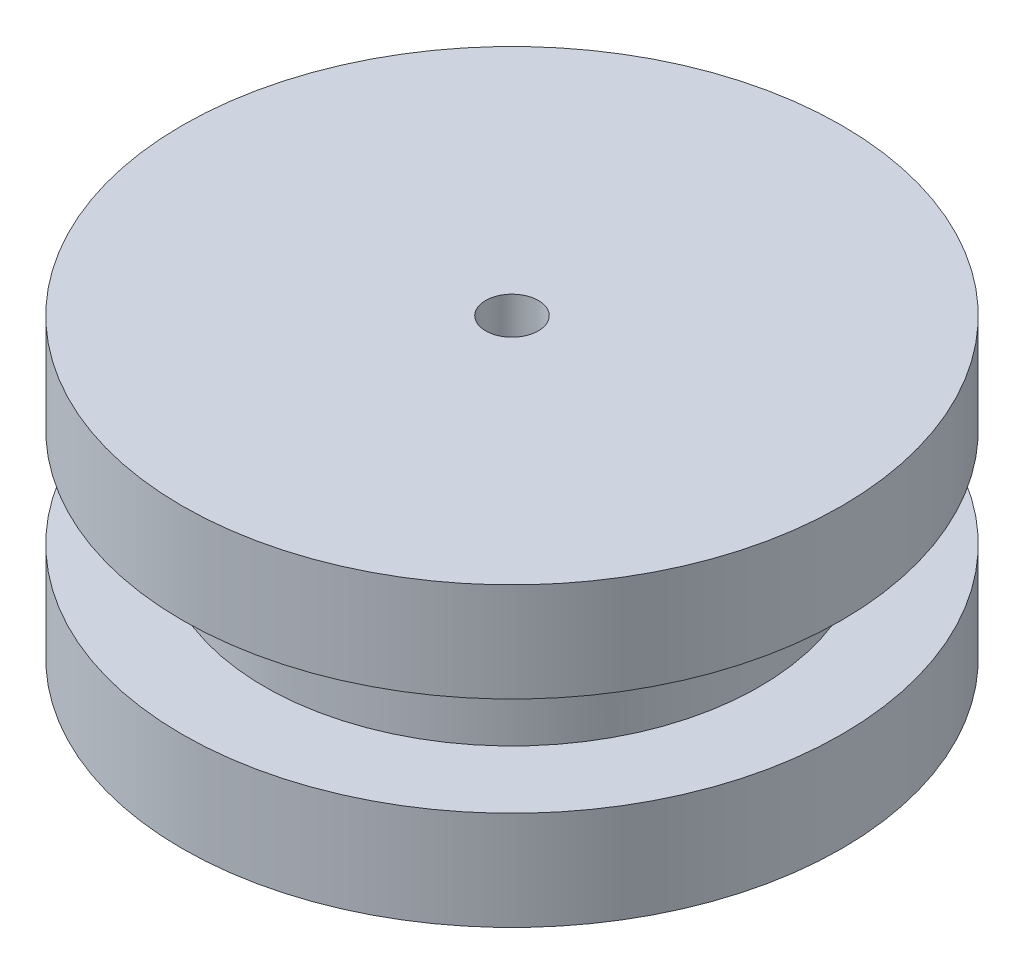
ISO-10303-21;
HEADER;
FILE_DESCRIPTION(('STEP AP214'),'2;1');
FILE_NAME('part.step','',(''),(''),'','','');
FILE_SCHEMA(('AUTOMOTIVE_DESIGN { 1 0 10303 214 1 1 1 1 }'));
ENDSEC;
DATA;
#1=APPLICATION_CONTEXT('core data for automotive mechanical design processes');
#2=APPLICATION_PROTOCOL_DEFINITION('international standard','automotive_design',2000,#1);
#3=PRODUCT_CONTEXT('',#1,'mechanical');
#4=PRODUCT('Part','Part','',(#3));
#5=PRODUCT_RELATED_PRODUCT_CATEGORY('part','',(#4));
#6=PRODUCT_DEFINITION_FORMATION('','',#4);
#7=PRODUCT_DEFINITION_CONTEXT('part definition',#1,'design');
#8=PRODUCT_DEFINITION('design','',#6,#7);
#9=PRODUCT_DEFINITION_SHAPE('','',#8);
#10=(LENGTH_UNIT() NAMED_UNIT(*) SI_UNIT(.MILLI.,.METRE.));
#11=(NAMED_UNIT(*) PLANE_ANGLE_UNIT() SI_UNIT($,.RADIAN.));
#12=(NAMED_UNIT(*) SI_UNIT($,.STERADIAN.) SOLID_ANGLE_UNIT());
#13=UNCERTAINTY_MEASURE_WITH_UNIT(LENGTH_MEASURE(1.E-05),#10,'distance_accuracy_value','');
#14=(GEOMETRIC_REPRESENTATION_CONTEXT(3) GLOBAL_UNCERTAINTY_ASSIGNED_CONTEXT((#13)) GLOBAL_UNIT_ASSIGNED_CONTEXT((#10,
#11,#12)) REPRESENTATION_CONTEXT('',''));
#15=CARTESIAN_POINT('',(0.,0.,0.));
#16=DIRECTION('',(0.,0.,1.));
#17=DIRECTION('',(1.,0.,0.));
#18=AXIS2_PLACEMENT_3D('',#15,#16,#17);
#19=CARTESIAN_POINT('',(0.,4.5,0.));
#20=DIRECTION('',(0.,-1.,0.));
#21=DIRECTION('',(0.,0.,-1.));
#22=AXIS2_PLACEMENT_3D('',#19,#20,#21);
#23=CYLINDRICAL_SURFACE('',#22,11.25);
#24=CARTESIAN_POINT('',(0.,4.5,0.));
#25=DIRECTION('',(0.,1.,0.));
#26=DIRECTION('',(0.,0.,1.));
#27=AXIS2_PLACEMENT_3D('',#24,#25,#26);
#28=CIRCLE('',#27,11.25);
#29=CARTESIAN_POINT('',(0.,4.5,11.25));
#30=VERTEX_POINT('',#29);
#31=EDGE_CURVE('E10',#30,#30,#28,.T.);
#32=ORIENTED_EDGE('',*,*,#31,.F.);
#33=EDGE_LOOP('',(#32));
#34=FACE_BOUND('',#33,.T.);
#35=CARTESIAN_POINT('',(0.,0.,0.));
#36=DIRECTION('',(0.,-1.,0.));
#37=DIRECTION('',(0.,0.,-1.));
#38=AXIS2_PLACEMENT_3D('',#35,#36,#37);
#39=CIRCLE('',#38,11.25);
#40=CARTESIAN_POINT('',(0.,0.,-11.25));
#41=VERTEX_POINT('',#40);
#42=EDGE_CURVE('E46',#41,#41,#39,.T.);
#43=ORIENTED_EDGE('',*,*,#42,.F.);
#44=EDGE_LOOP('',(#43));
#45=FACE_BOUND('',#44,.T.);
#46=ADVANCED_FACE('F31',(#34,#45),#23,.T.);
#47=CARTESIAN_POINT('',(0.,4.5,0.));
#48=DIRECTION('',(0.,1.,0.));
#49=DIRECTION('',(0.,0.,1.));
#50=AXIS2_PLACEMENT_3D('',#47,#48,#49);
#51=PLANE('',#50);
#52=CARTESIAN_POINT('',(0.,4.5,0.));
#53=DIRECTION('',(0.,1.,0.));
#54=DIRECTION('',(0.,0.,1.));
#55=AXIS2_PLACEMENT_3D('',#52,#53,#54);
#56=CIRCLE('',#55,15.);
#57=CARTESIAN_POINT('',(0.,4.5,15.));
#58=VERTEX_POINT('',#57);
#59=EDGE_CURVE('E41',#58,#58,#56,.T.);
#60=ORIENTED_EDGE('',*,*,#59,.F.);
#61=EDGE_LOOP('',(#60));
#62=FACE_BOUND('',#61,.T.);
#63=ORIENTED_EDGE('',*,*,#31,.T.);
#64=EDGE_LOOP('',(#63));
#65=FACE_BOUND('',#64,.T.);
#66=ADVANCED_FACE('F85',(#62,#65),#51,.F.);
#67=CARTESIAN_POINT('',(0.,9.,0.));
#68=DIRECTION('',(0.,-1.,0.));
#69=DIRECTION('',(0.,0.,-1.));
#70=AXIS2_PLACEMENT_3D('',#67,#68,#69);
#71=CYLINDRICAL_SURFACE('',#70,15.);
#72=CARTESIAN_POINT('',(0.,9.,0.));
#73=DIRECTION('',(0.,1.,0.));
#74=DIRECTION('',(0.,0.,1.));
#75=AXIS2_PLACEMENT_3D('',#72,#73,#74);
#76=CIRCLE('',#75,15.);
#77=CARTESIAN_POINT('',(0.,9.,15.));
#78=VERTEX_POINT('',#77);
#79=EDGE_CURVE('E37',#78,#78,#76,.T.);
#80=ORIENTED_EDGE('',*,*,#79,.F.);
#81=EDGE_LOOP('',(#80));
#82=FACE_BOUND('',#81,.T.);
#83=ORIENTED_EDGE('',*,*,#59,.T.);
#84=EDGE_LOOP('',(#83));
#85=FACE_BOUND('',#84,.T.);
#86=ADVANCED_FACE('F90',(#82,#85),#71,.T.);
#87=CARTESIAN_POINT('',(0.,9.,0.));
#88=DIRECTION('',(0.,1.,0.));
#89=DIRECTION('',(0.,0.,1.));
#90=AXIS2_PLACEMENT_3D('',#87,#88,#89);
#91=PLANE('',#90);
#92=CARTESIAN_POINT('',(0.,9.,0.));
#93=DIRECTION('',(0.,-1.,0.));
#94=DIRECTION('',(0.,0.,-1.));
#95=AXIS2_PLACEMENT_3D('',#92,#93,#94);
#96=CIRCLE('',#95,1.2);
#97=CARTESIAN_POINT('',(0.,9.,-1.2));
#98=VERTEX_POINT('',#97);
#99=EDGE_CURVE('E54',#98,#98,#96,.T.);
#100=ORIENTED_EDGE('',*,*,#99,.T.);
#101=EDGE_LOOP('',(#100));
#102=FACE_BOUND('',#101,.T.);
#103=ORIENTED_EDGE('',*,*,#79,.T.);
#104=EDGE_LOOP('',(#103));
#105=FACE_BOUND('',#104,.T.);
#106=ADVANCED_FACE('F80',(#102,#105),#91,.T.);
#107=CARTESIAN_POINT('',(0.,0.,0.));
#108=DIRECTION('',(0.,-1.,0.));
#109=DIRECTION('',(0.,0.,-1.));
#110=AXIS2_PLACEMENT_3D('',#107,#108,#109);
#111=PLANE('',#110);
#112=CARTESIAN_POINT('',(0.,0.,0.));
#113=DIRECTION('',(0.,-1.,0.));
#114=DIRECTION('',(0.,0.,-1.));
#115=AXIS2_PLACEMENT_3D('',#112,#113,#114);
#116=CIRCLE('',#115,15.);
#117=CARTESIAN_POINT('',(0.,0.,-15.));
#118=VERTEX_POINT('',#117);
#119=EDGE_CURVE('E51',#118,#118,#116,.T.);
#120=ORIENTED_EDGE('',*,*,#119,.F.);
#121=EDGE_LOOP('',(#120));
#122=FACE_BOUND('',#121,.T.);
#123=ORIENTED_EDGE('',*,*,#42,.T.);
#124=EDGE_LOOP('',(#123));
#125=FACE_BOUND('',#124,.T.);
#126=ADVANCED_FACE('F74',(#122,#125),#111,.F.);
#127=CARTESIAN_POINT('',(0.,-4.5,0.));
#128=DIRECTION('',(0.,1.,0.));
#129=DIRECTION('',(0.,0.,1.));
#130=AXIS2_PLACEMENT_3D('',#127,#128,#129);
#131=CYLINDRICAL_SURFACE('',#130,15.);
#132=CARTESIAN_POINT('',(0.,-4.5,0.));
#133=DIRECTION('',(0.,-1.,0.));
#134=DIRECTION('',(0.,0.,-1.));
#135=AXIS2_PLACEMENT_3D('',#132,#133,#134);
#136=CIRCLE('',#135,15.);
#137=CARTESIAN_POINT('',(0.,-4.5,-15.));
#138=VERTEX_POINT('',#137);
#139=EDGE_CURVE('E50',#138,#138,#136,.T.);
#140=ORIENTED_EDGE('',*,*,#139,.F.);
#141=EDGE_LOOP('',(#140));
#142=FACE_BOUND('',#141,.T.);
#143=ORIENTED_EDGE('',*,*,#119,.T.);
#144=EDGE_LOOP('',(#143));
#145=FACE_BOUND('',#144,.T.);
#146=ADVANCED_FACE('F68',(#142,#145),#131,.T.);
#147=CARTESIAN_POINT('',(0.,-4.5,0.));
#148=DIRECTION('',(0.,-1.,0.));
#149=DIRECTION('',(0.,0.,-1.));
#150=AXIS2_PLACEMENT_3D('',#147,#148,#149);
#151=PLANE('',#150);
#152=CARTESIAN_POINT('',(0.,-4.5,0.));
#153=DIRECTION('',(0.,-1.,0.));
#154=DIRECTION('',(0.,0.,-1.));
#155=AXIS2_PLACEMENT_3D('',#152,#153,#154);
#156=CIRCLE('',#155,1.2);
#157=CARTESIAN_POINT('',(0.,-4.5,-1.2));
#158=VERTEX_POINT('',#157);
#159=EDGE_CURVE('E59',#158,#158,#156,.T.);
#160=ORIENTED_EDGE('',*,*,#159,.F.);
#161=EDGE_LOOP('',(#160));
#162=FACE_BOUND('',#161,.T.);
#163=ORIENTED_EDGE('',*,*,#139,.T.);
#164=EDGE_LOOP('',(#163));
#165=FACE_BOUND('',#164,.T.);
#166=ADVANCED_FACE('F65',(#162,#165),#151,.T.);
#167=CARTESIAN_POINT('',(0.,-4.5,0.));
#168=DIRECTION('',(0.,-1.,0.));
#169=DIRECTION('',(0.,0.,-1.));
#170=AXIS2_PLACEMENT_3D('',#167,#168,#169);
#171=CYLINDRICAL_SURFACE('',#170,1.2);
#172=ORIENTED_EDGE('',*,*,#99,.F.);
#173=EDGE_LOOP('',(#172));
#174=FACE_BOUND('',#173,.T.);
#175=ORIENTED_EDGE('',*,*,#159,.T.);
#176=EDGE_LOOP('',(#175));
#177=FACE_BOUND('',#176,.T.);
#178=ADVANCED_FACE('F63',(#174,#177),#171,.F.);
#179=CLOSED_SHELL('',(#46,#66,#86,#106,#126,#146,#166,#178));
#180=MANIFOLD_SOLID_BREP('B2',#179);
#181=ADVANCED_BREP_SHAPE_REPRESENTATION('',(#18,#180),#14);
#182=SHAPE_DEFINITION_REPRESENTATION(#9,#181);
ENDSEC;
END-ISO-10303-21;
